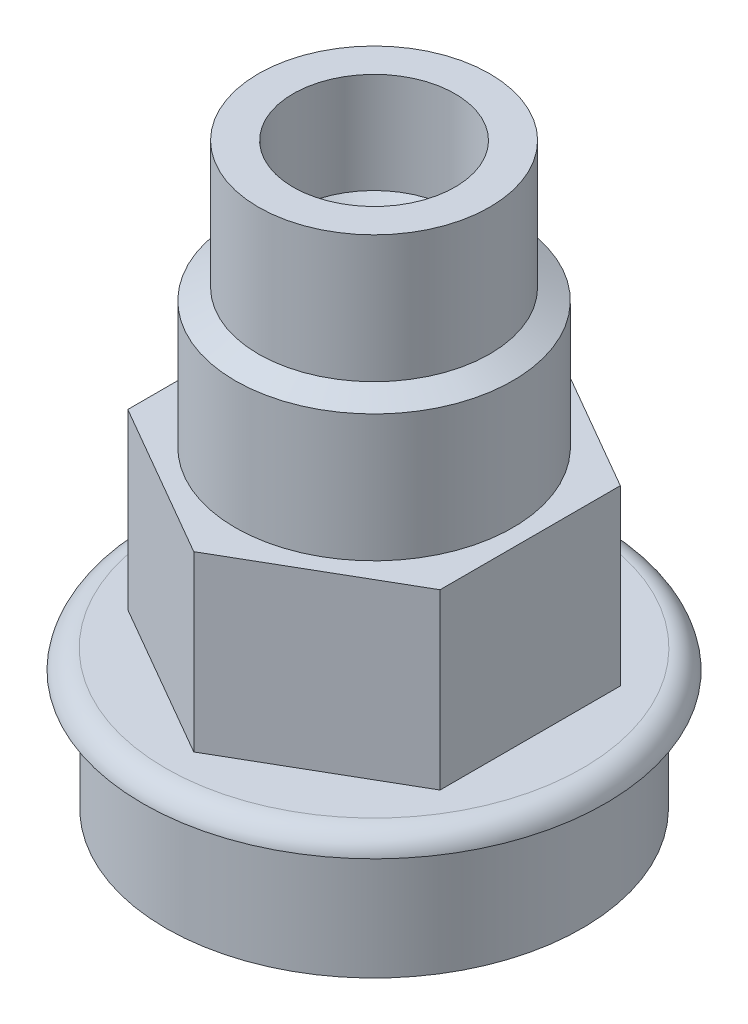
ISO-10303-21;
HEADER;
FILE_DESCRIPTION(('STEP AP214'),'2;1');
FILE_NAME('part.step','',(''),(''),'','','');
FILE_SCHEMA(('AUTOMOTIVE_DESIGN { 1 0 10303 214 1 1 1 1 }'));
ENDSEC;
DATA;
#1=APPLICATION_CONTEXT('core data for automotive mechanical design processes');
#2=APPLICATION_PROTOCOL_DEFINITION('international standard','automotive_design',2000,#1);
#3=PRODUCT_CONTEXT('',#1,'mechanical');
#4=PRODUCT('Part','Part','',(#3));
#5=PRODUCT_RELATED_PRODUCT_CATEGORY('part','',(#4));
#6=PRODUCT_DEFINITION_FORMATION('','',#4);
#7=PRODUCT_DEFINITION_CONTEXT('part definition',#1,'design');
#8=PRODUCT_DEFINITION('design','',#6,#7);
#9=PRODUCT_DEFINITION_SHAPE('','',#8);
#10=(LENGTH_UNIT() NAMED_UNIT(*) SI_UNIT(.MILLI.,.METRE.));
#11=(NAMED_UNIT(*) PLANE_ANGLE_UNIT() SI_UNIT($,.RADIAN.));
#12=(NAMED_UNIT(*) SI_UNIT($,.STERADIAN.) SOLID_ANGLE_UNIT());
#13=UNCERTAINTY_MEASURE_WITH_UNIT(LENGTH_MEASURE(1.E-05),#10,'distance_accuracy_value','');
#14=(GEOMETRIC_REPRESENTATION_CONTEXT(3) GLOBAL_UNCERTAINTY_ASSIGNED_CONTEXT((#13)) GLOBAL_UNIT_ASSIGNED_CONTEXT((#10,
#11,#12)) REPRESENTATION_CONTEXT('',''));
#15=CARTESIAN_POINT('',(0.,0.,0.));
#16=DIRECTION('',(0.,0.,1.));
#17=DIRECTION('',(1.,0.,0.));
#18=AXIS2_PLACEMENT_3D('',#15,#16,#17);
#19=CARTESIAN_POINT('',(0.,-13.,-13.));
#20=DIRECTION('',(0.,-1.,0.));
#21=DIRECTION('',(0.,0.,-1.));
#22=AXIS2_PLACEMENT_3D('',#19,#20,#21);
#23=PLANE('',#22);
#24=CARTESIAN_POINT('',(0.,-13.,0.));
#25=DIRECTION('',(0.,1.,0.));
#26=DIRECTION('',(0.,0.,1.));
#27=AXIS2_PLACEMENT_3D('',#24,#25,#26);
#28=CIRCLE('',#27,18.0292061100604);
#29=CARTESIAN_POINT('',(0.,-13.,18.0292061100604));
#30=VERTEX_POINT('',#29);
#31=EDGE_CURVE('E202',#30,#30,#28,.T.);
#32=ORIENTED_EDGE('',*,*,#31,.T.);
#33=EDGE_LOOP('',(#32));
#34=FACE_BOUND('',#33,.T.);
#35=DIRECTION('',(0.,0.,-1.));
#36=VECTOR('',#35,1.);
#37=CARTESIAN_POINT('',(13.5,-13.,7.79422863405995));
#38=LINE('',#37,#36);
#39=CARTESIAN_POINT('',(13.5,-13.,7.79422863405995));
#40=VERTEX_POINT('',#39);
#41=CARTESIAN_POINT('',(13.5,-13.,-7.79422863405996));
#42=VERTEX_POINT('',#41);
#43=EDGE_CURVE('E66',#40,#42,#38,.T.);
#44=ORIENTED_EDGE('',*,*,#43,.F.);
#45=DIRECTION('',(0.866025403784439,0.,-0.5));
#46=VECTOR('',#45,1.);
#47=CARTESIAN_POINT('',(0.,-13.,15.5884572681199));
#48=LINE('',#47,#46);
#49=CARTESIAN_POINT('',(0.,-13.,15.5884572681199));
#50=VERTEX_POINT('',#49);
#51=EDGE_CURVE('E71',#50,#40,#48,.T.);
#52=ORIENTED_EDGE('',*,*,#51,.F.);
#53=DIRECTION('',(0.866025403784439,0.,0.5));
#54=VECTOR('',#53,1.);
#55=CARTESIAN_POINT('',(-13.5,-13.,7.79422863405995));
#56=LINE('',#55,#54);
#57=CARTESIAN_POINT('',(-13.5,-13.,7.79422863405995));
#58=VERTEX_POINT('',#57);
#59=EDGE_CURVE('E163',#58,#50,#56,.T.);
#60=ORIENTED_EDGE('',*,*,#59,.F.);
#61=DIRECTION('',(0.,0.,1.));
#62=VECTOR('',#61,1.);
#63=CARTESIAN_POINT('',(-13.5,-13.,-7.79422863405996));
#64=LINE('',#63,#62);
#65=CARTESIAN_POINT('',(-13.5,-13.,-7.79422863405996));
#66=VERTEX_POINT('',#65);
#67=EDGE_CURVE('E159',#66,#58,#64,.T.);
#68=ORIENTED_EDGE('',*,*,#67,.F.);
#69=DIRECTION('',(-0.866025403784439,0.,0.5));
#70=VECTOR('',#69,1.);
#71=CARTESIAN_POINT('',(0.,-13.,-15.5884572681199));
#72=LINE('',#71,#70);
#73=CARTESIAN_POINT('',(0.,-13.,-15.5884572681199));
#74=VERTEX_POINT('',#73);
#75=EDGE_CURVE('E155',#74,#66,#72,.T.);
#76=ORIENTED_EDGE('',*,*,#75,.F.);
#77=DIRECTION('',(-0.866025403784439,0.,-0.5));
#78=VECTOR('',#77,1.);
#79=CARTESIAN_POINT('',(13.5,-13.,-7.79422863405996));
#80=LINE('',#79,#78);
#81=EDGE_CURVE('E152',#42,#74,#80,.T.);
#82=ORIENTED_EDGE('',*,*,#81,.F.);
#83=EDGE_LOOP('',(#44,#52,#60,#68,#76,#82));
#84=FACE_BOUND('',#83,.T.);
#85=ADVANCED_FACE('F49',(#34,#84),#23,.F.);
#86=CARTESIAN_POINT('',(0.,-25.,-18.));
#87=DIRECTION('',(0.,1.,0.));
#88=DIRECTION('',(0.,0.,1.));
#89=AXIS2_PLACEMENT_3D('',#86,#87,#88);
#90=PLANE('',#89);
#91=CARTESIAN_POINT('',(0.,-25.,0.));
#92=DIRECTION('',(0.,1.,0.));
#93=DIRECTION('',(0.,0.,1.));
#94=AXIS2_PLACEMENT_3D('',#91,#92,#93);
#95=CIRCLE('',#94,18.);
#96=CARTESIAN_POINT('',(0.,-25.,18.));
#97=VERTEX_POINT('',#96);
#98=EDGE_CURVE('E190',#97,#97,#95,.T.);
#99=ORIENTED_EDGE('',*,*,#98,.F.);
#100=EDGE_LOOP('',(#99));
#101=FACE_BOUND('',#100,.T.);
#102=CARTESIAN_POINT('',(0.,-25.,0.));
#103=DIRECTION('',(0.,1.,0.));
#104=DIRECTION('',(0.,0.,1.));
#105=AXIS2_PLACEMENT_3D('',#102,#103,#104);
#106=CIRCLE('',#105,14.1517153305609);
#107=CARTESIAN_POINT('',(0.,-25.,14.1517153305609));
#108=VERTEX_POINT('',#107);
#109=EDGE_CURVE('E53',#108,#108,#106,.T.);
#110=ORIENTED_EDGE('',*,*,#109,.T.);
#111=EDGE_LOOP('',(#110));
#112=FACE_BOUND('',#111,.T.);
#113=ADVANCED_FACE('F51',(#101,#112),#90,.F.);
#114=CARTESIAN_POINT('',(0.,-24.,0.));
#115=DIRECTION('',(0.,-1.,0.));
#116=DIRECTION('',(0.,0.,-1.));
#117=AXIS2_PLACEMENT_3D('',#114,#115,#116);
#118=CONICAL_SURFACE('',#117,13.,0.855790680962079);
#119=ORIENTED_EDGE('',*,*,#109,.F.);
#120=EDGE_LOOP('',(#119));
#121=FACE_BOUND('',#120,.T.);
#122=CARTESIAN_POINT('',(0.,-24.,0.));
#123=DIRECTION('',(0.,1.,0.));
#124=DIRECTION('',(0.,0.,1.));
#125=AXIS2_PLACEMENT_3D('',#122,#123,#124);
#126=CIRCLE('',#125,13.);
#127=CARTESIAN_POINT('',(0.,-24.,13.));
#128=VERTEX_POINT('',#127);
#129=EDGE_CURVE('E205',#128,#128,#126,.T.);
#130=ORIENTED_EDGE('',*,*,#129,.T.);
#131=EDGE_LOOP('',(#130));
#132=FACE_BOUND('',#131,.T.);
#133=ADVANCED_FACE('F215',(#121,#132),#118,.F.);
#134=CARTESIAN_POINT('',(0.,25.,0.));
#135=DIRECTION('',(0.,1.,0.));
#136=DIRECTION('',(0.,0.,1.));
#137=AXIS2_PLACEMENT_3D('',#134,#135,#136);
#138=CYLINDRICAL_SURFACE('',#137,13.);
#139=ORIENTED_EDGE('',*,*,#129,.F.);
#140=EDGE_LOOP('',(#139));
#141=FACE_BOUND('',#140,.T.);
#142=CARTESIAN_POINT('',(0.,-13.,0.));
#143=DIRECTION('',(0.,1.,0.));
#144=DIRECTION('',(0.,0.,1.));
#145=AXIS2_PLACEMENT_3D('',#142,#143,#144);
#146=CIRCLE('',#145,13.);
#147=CARTESIAN_POINT('',(0.,-13.,13.));
#148=VERTEX_POINT('',#147);
#149=EDGE_CURVE('E185',#148,#148,#146,.F.);
#150=ORIENTED_EDGE('',*,*,#149,.F.);
#151=EDGE_LOOP('',(#150));
#152=FACE_BOUND('',#151,.T.);
#153=ADVANCED_FACE('F217',(#141,#152),#138,.F.);
#154=CARTESIAN_POINT('',(0.,-15.,0.));
#155=DIRECTION('',(0.,1.,0.));
#156=DIRECTION('',(0.,0.,1.));
#157=AXIS2_PLACEMENT_3D('',#154,#155,#156);
#158=TOROIDAL_SURFACE('',#157,18.0292061100604,2.);
#159=ORIENTED_EDGE('',*,*,#31,.F.);
#160=EDGE_LOOP('',(#159));
#161=FACE_BOUND('',#160,.T.);
#162=CARTESIAN_POINT('',(0.,-14.6594541978282,0.));
#163=DIRECTION('',(0.,1.,0.));
#164=DIRECTION('',(0.,0.,1.));
#165=AXIS2_PLACEMENT_3D('',#162,#163,#164);
#166=CIRCLE('',#165,20.);
#167=CARTESIAN_POINT('',(0.,-14.6594541978282,20.));
#168=VERTEX_POINT('',#167);
#169=EDGE_CURVE('E198',#168,#168,#166,.T.);
#170=ORIENTED_EDGE('',*,*,#169,.T.);
#171=EDGE_LOOP('',(#170));
#172=FACE_BOUND('',#171,.T.);
#173=ADVANCED_FACE('F222',(#161,#172),#158,.T.);
#174=CARTESIAN_POINT('',(0.,-14.6594541978282,-20.));
#175=DIRECTION('',(0.,1.,0.));
#176=DIRECTION('',(0.,0.,1.));
#177=AXIS2_PLACEMENT_3D('',#174,#175,#176);
#178=PLANE('',#177);
#179=ORIENTED_EDGE('',*,*,#169,.F.);
#180=EDGE_LOOP('',(#179));
#181=FACE_BOUND('',#180,.T.);
#182=CARTESIAN_POINT('',(0.,-14.6594541978282,0.));
#183=DIRECTION('',(0.,1.,0.));
#184=DIRECTION('',(0.,0.,1.));
#185=AXIS2_PLACEMENT_3D('',#182,#183,#184);
#186=CIRCLE('',#185,18.);
#187=CARTESIAN_POINT('',(0.,-14.6594541978282,18.));
#188=VERTEX_POINT('',#187);
#189=EDGE_CURVE('E194',#188,#188,#186,.T.);
#190=ORIENTED_EDGE('',*,*,#189,.T.);
#191=EDGE_LOOP('',(#190));
#192=FACE_BOUND('',#191,.T.);
#193=ADVANCED_FACE('F234',(#181,#192),#178,.F.);
#194=CARTESIAN_POINT('',(0.,25.,0.));
#195=DIRECTION('',(0.,1.,0.));
#196=DIRECTION('',(0.,0.,1.));
#197=AXIS2_PLACEMENT_3D('',#194,#195,#196);
#198=CYLINDRICAL_SURFACE('',#197,18.);
#199=ORIENTED_EDGE('',*,*,#189,.F.);
#200=EDGE_LOOP('',(#199));
#201=FACE_BOUND('',#200,.T.);
#202=ORIENTED_EDGE('',*,*,#98,.T.);
#203=EDGE_LOOP('',(#202));
#204=FACE_BOUND('',#203,.T.);
#205=ADVANCED_FACE('F238',(#201,#204),#198,.T.);
#206=CARTESIAN_POINT('',(0.,-13.,0.));
#207=DIRECTION('',(0.,1.,0.));
#208=DIRECTION('',(0.,0.,1.));
#209=AXIS2_PLACEMENT_3D('',#206,#207,#208);
#210=PLANE('',#209);
#211=CARTESIAN_POINT('',(0.,-13.,0.));
#212=DIRECTION('',(0.,1.,0.));
#213=DIRECTION('',(0.,0.,1.));
#214=AXIS2_PLACEMENT_3D('',#211,#212,#213);
#215=CIRCLE('',#214,9.);
#216=CARTESIAN_POINT('',(0.,-13.,9.));
#217=VERTEX_POINT('',#216);
#218=EDGE_CURVE('E123',#217,#217,#215,.T.);
#219=ORIENTED_EDGE('',*,*,#218,.T.);
#220=EDGE_LOOP('',(#219));
#221=FACE_BOUND('',#220,.T.);
#222=ORIENTED_EDGE('',*,*,#149,.T.);
#223=EDGE_LOOP('',(#222));
#224=FACE_BOUND('',#223,.T.);
#225=ADVANCED_FACE('F242',(#221,#224),#210,.F.);
#226=CARTESIAN_POINT('',(13.5,43.2431812546026,7.79422863405996));
#227=DIRECTION('',(-1.,0.,0.));
#228=DIRECTION('',(0.,0.,1.));
#229=AXIS2_PLACEMENT_3D('',#226,#227,#228);
#230=PLANE('',#229);
#231=DIRECTION('',(0.,0.,-1.));
#232=VECTOR('',#231,1.);
#233=CARTESIAN_POINT('',(13.5,2.,7.79422863405995));
#234=LINE('',#233,#232);
#235=CARTESIAN_POINT('',(13.5,2.,7.79422863405995));
#236=VERTEX_POINT('',#235);
#237=CARTESIAN_POINT('',(13.5,2.,-7.79422863405996));
#238=VERTEX_POINT('',#237);
#239=EDGE_CURVE('E107',#236,#238,#234,.T.);
#240=ORIENTED_EDGE('',*,*,#239,.F.);
#241=DIRECTION('',(0.,-1.,0.));
#242=VECTOR('',#241,1.);
#243=CARTESIAN_POINT('',(13.5,43.2431812546026,7.79422863405996));
#244=LINE('',#243,#242);
#245=EDGE_CURVE('E112',#236,#40,#244,.T.);
#246=ORIENTED_EDGE('',*,*,#245,.T.);
#247=ORIENTED_EDGE('',*,*,#43,.T.);
#248=DIRECTION('',(0.,-1.,0.));
#249=VECTOR('',#248,1.);
#250=CARTESIAN_POINT('',(13.5,43.2431812546026,-7.79422863405995));
#251=LINE('',#250,#249);
#252=EDGE_CURVE('E103',#238,#42,#251,.T.);
#253=ORIENTED_EDGE('',*,*,#252,.F.);
#254=EDGE_LOOP('',(#240,#246,#247,#253));
#255=FACE_BOUND('',#254,.T.);
#256=ADVANCED_FACE('F105',(#255),#230,.F.);
#257=CARTESIAN_POINT('',(0.,43.2431812546026,15.5884572681199));
#258=DIRECTION('',(-0.5,0.,-0.866025403784439));
#259=DIRECTION('',(-0.866025403784439,0.,0.5));
#260=AXIS2_PLACEMENT_3D('',#257,#258,#259);
#261=PLANE('',#260);
#262=DIRECTION('',(0.866025403784439,0.,-0.5));
#263=VECTOR('',#262,1.);
#264=CARTESIAN_POINT('',(0.,1.99999999999999,15.5884572681199));
#265=LINE('',#264,#263);
#266=CARTESIAN_POINT('',(0.,1.99999999999999,15.5884572681199));
#267=VERTEX_POINT('',#266);
#268=EDGE_CURVE('E128',#267,#236,#265,.T.);
#269=ORIENTED_EDGE('',*,*,#268,.F.);
#270=DIRECTION('',(0.,-1.,0.));
#271=VECTOR('',#270,1.);
#272=CARTESIAN_POINT('',(0.,43.2431812546026,15.5884572681199));
#273=LINE('',#272,#271);
#274=EDGE_CURVE('E173',#267,#50,#273,.T.);
#275=ORIENTED_EDGE('',*,*,#274,.T.);
#276=ORIENTED_EDGE('',*,*,#51,.T.);
#277=ORIENTED_EDGE('',*,*,#245,.F.);
#278=EDGE_LOOP('',(#269,#275,#276,#277));
#279=FACE_BOUND('',#278,.T.);
#280=ADVANCED_FACE('F258',(#279),#261,.F.);
#281=CARTESIAN_POINT('',(-13.5,43.2431812546026,7.79422863405996));
#282=DIRECTION('',(0.5,0.,-0.866025403784439));
#283=DIRECTION('',(-0.866025403784439,0.,-0.5));
#284=AXIS2_PLACEMENT_3D('',#281,#282,#283);
#285=PLANE('',#284);
#286=DIRECTION('',(0.866025403784439,0.,0.5));
#287=VECTOR('',#286,1.);
#288=CARTESIAN_POINT('',(-13.5,2.,7.79422863405995));
#289=LINE('',#288,#287);
#290=CARTESIAN_POINT('',(-13.5,2.,7.79422863405995));
#291=VERTEX_POINT('',#290);
#292=EDGE_CURVE('E134',#291,#267,#289,.T.);
#293=ORIENTED_EDGE('',*,*,#292,.F.);
#294=DIRECTION('',(0.,-1.,0.));
#295=VECTOR('',#294,1.);
#296=CARTESIAN_POINT('',(-13.5,43.2431812546026,7.79422863405996));
#297=LINE('',#296,#295);
#298=EDGE_CURVE('E176',#291,#58,#297,.T.);
#299=ORIENTED_EDGE('',*,*,#298,.T.);
#300=ORIENTED_EDGE('',*,*,#59,.T.);
#301=ORIENTED_EDGE('',*,*,#274,.F.);
#302=EDGE_LOOP('',(#293,#299,#300,#301));
#303=FACE_BOUND('',#302,.T.);
#304=ADVANCED_FACE('F254',(#303),#285,.F.);
#305=CARTESIAN_POINT('',(-13.5,43.2431812546026,-7.79422863405995));
#306=DIRECTION('',(1.,0.,0.));
#307=DIRECTION('',(0.,0.,-1.));
#308=AXIS2_PLACEMENT_3D('',#305,#306,#307);
#309=PLANE('',#308);
#310=DIRECTION('',(0.,0.,1.));
#311=VECTOR('',#310,1.);
#312=CARTESIAN_POINT('',(-13.5,2.,-7.79422863405996));
#313=LINE('',#312,#311);
#314=CARTESIAN_POINT('',(-13.5,2.,-7.79422863405996));
#315=VERTEX_POINT('',#314);
#316=EDGE_CURVE('E143',#315,#291,#313,.T.);
#317=ORIENTED_EDGE('',*,*,#316,.F.);
#318=DIRECTION('',(0.,-1.,0.));
#319=VECTOR('',#318,1.);
#320=CARTESIAN_POINT('',(-13.5,43.2431812546026,-7.79422863405995));
#321=LINE('',#320,#319);
#322=EDGE_CURVE('E180',#315,#66,#321,.T.);
#323=ORIENTED_EDGE('',*,*,#322,.T.);
#324=ORIENTED_EDGE('',*,*,#67,.T.);
#325=ORIENTED_EDGE('',*,*,#298,.F.);
#326=EDGE_LOOP('',(#317,#323,#324,#325));
#327=FACE_BOUND('',#326,.T.);
#328=ADVANCED_FACE('F250',(#327),#309,.F.);
#329=CARTESIAN_POINT('',(0.,43.2431812546026,-15.5884572681199));
#330=DIRECTION('',(0.5,0.,0.866025403784439));
#331=DIRECTION('',(0.866025403784439,0.,-0.5));
#332=AXIS2_PLACEMENT_3D('',#329,#330,#331);
#333=PLANE('',#332);
#334=DIRECTION('',(-0.866025403784439,0.,0.5));
#335=VECTOR('',#334,1.);
#336=CARTESIAN_POINT('',(0.,2.,-15.5884572681199));
#337=LINE('',#336,#335);
#338=CARTESIAN_POINT('',(0.,2.,-15.5884572681199));
#339=VERTEX_POINT('',#338);
#340=EDGE_CURVE('E124',#339,#315,#337,.T.);
#341=ORIENTED_EDGE('',*,*,#340,.F.);
#342=DIRECTION('',(0.,-1.,0.));
#343=VECTOR('',#342,1.);
#344=CARTESIAN_POINT('',(0.,43.2431812546026,-15.5884572681199));
#345=LINE('',#344,#343);
#346=EDGE_CURVE('E119',#339,#74,#345,.T.);
#347=ORIENTED_EDGE('',*,*,#346,.T.);
#348=ORIENTED_EDGE('',*,*,#75,.T.);
#349=ORIENTED_EDGE('',*,*,#322,.F.);
#350=EDGE_LOOP('',(#341,#347,#348,#349));
#351=FACE_BOUND('',#350,.T.);
#352=ADVANCED_FACE('F247',(#351),#333,.F.);
#353=CARTESIAN_POINT('',(13.5,43.2431812546026,-7.79422863405995));
#354=DIRECTION('',(-0.5,0.,0.866025403784439));
#355=DIRECTION('',(0.866025403784439,0.,0.5));
#356=AXIS2_PLACEMENT_3D('',#353,#354,#355);
#357=PLANE('',#356);
#358=DIRECTION('',(-0.866025403784439,0.,-0.5));
#359=VECTOR('',#358,1.);
#360=CARTESIAN_POINT('',(13.5,2.,-7.79422863405995));
#361=LINE('',#360,#359);
#362=EDGE_CURVE('E116',#238,#339,#361,.T.);
#363=ORIENTED_EDGE('',*,*,#362,.F.);
#364=ORIENTED_EDGE('',*,*,#252,.T.);
#365=ORIENTED_EDGE('',*,*,#81,.T.);
#366=ORIENTED_EDGE('',*,*,#346,.F.);
#367=EDGE_LOOP('',(#363,#364,#365,#366));
#368=FACE_BOUND('',#367,.T.);
#369=ADVANCED_FACE('F117',(#368),#357,.F.);
#370=CARTESIAN_POINT('',(0.,43.2431812546026,0.));
#371=DIRECTION('',(0.,-1.,0.));
#372=DIRECTION('',(0.,0.,-1.));
#373=AXIS2_PLACEMENT_3D('',#370,#371,#372);
#374=CYLINDRICAL_SURFACE('',#373,9.);
#375=ORIENTED_EDGE('',*,*,#218,.F.);
#376=EDGE_LOOP('',(#375));
#377=FACE_BOUND('',#376,.T.);
#378=CARTESIAN_POINT('',(0.,2.,0.));
#379=DIRECTION('',(0.,1.,0.));
#380=DIRECTION('',(0.,0.,1.));
#381=AXIS2_PLACEMENT_3D('',#378,#379,#380);
#382=CIRCLE('',#381,9.);
#383=CARTESIAN_POINT('',(0.,2.,9.));
#384=VERTEX_POINT('',#383);
#385=EDGE_CURVE('E130',#384,#384,#382,.T.);
#386=ORIENTED_EDGE('',*,*,#385,.T.);
#387=EDGE_LOOP('',(#386));
#388=FACE_BOUND('',#387,.T.);
#389=ADVANCED_FACE('F246',(#377,#388),#374,.F.);
#390=CARTESIAN_POINT('',(0.,2.,-7.));
#391=DIRECTION('',(0.,1.,0.));
#392=DIRECTION('',(0.,0.,1.));
#393=AXIS2_PLACEMENT_3D('',#390,#391,#392);
#394=PLANE('',#393);
#395=CARTESIAN_POINT('',(0.,2.,0.));
#396=DIRECTION('',(0.,1.,0.));
#397=DIRECTION('',(0.,0.,1.));
#398=AXIS2_PLACEMENT_3D('',#395,#396,#397);
#399=CIRCLE('',#398,12.);
#400=CARTESIAN_POINT('',(0.,2.,12.));
#401=VERTEX_POINT('',#400);
#402=EDGE_CURVE('E11',#401,#401,#399,.T.);
#403=ORIENTED_EDGE('',*,*,#402,.F.);
#404=EDGE_LOOP('',(#403));
#405=FACE_BOUND('',#404,.T.);
#406=ORIENTED_EDGE('',*,*,#239,.T.);
#407=ORIENTED_EDGE('',*,*,#362,.T.);
#408=ORIENTED_EDGE('',*,*,#340,.T.);
#409=ORIENTED_EDGE('',*,*,#316,.T.);
#410=ORIENTED_EDGE('',*,*,#292,.T.);
#411=ORIENTED_EDGE('',*,*,#268,.T.);
#412=EDGE_LOOP('',(#406,#407,#408,#409,#410,#411));
#413=FACE_BOUND('',#412,.T.);
#414=ADVANCED_FACE('F126',(#405,#413),#394,.T.);
#415=CARTESIAN_POINT('',(0.,2.,-7.));
#416=DIRECTION('',(0.,1.,0.));
#417=DIRECTION('',(0.,0.,1.));
#418=AXIS2_PLACEMENT_3D('',#415,#416,#417);
#419=PLANE('',#418);
#420=ORIENTED_EDGE('',*,*,#385,.F.);
#421=EDGE_LOOP('',(#420));
#422=FACE_BOUND('',#421,.T.);
#423=CARTESIAN_POINT('',(0.,2.,0.));
#424=DIRECTION('',(0.,1.,0.));
#425=DIRECTION('',(0.,0.,1.));
#426=AXIS2_PLACEMENT_3D('',#423,#424,#425);
#427=CIRCLE('',#426,7.00000000000001);
#428=CARTESIAN_POINT('',(0.,2.,7.00000000000001));
#429=VERTEX_POINT('',#428);
#430=EDGE_CURVE('E318',#429,#429,#427,.T.);
#431=ORIENTED_EDGE('',*,*,#430,.T.);
#432=EDGE_LOOP('',(#431));
#433=FACE_BOUND('',#432,.T.);
#434=ADVANCED_FACE('F273',(#422,#433),#419,.F.);
#435=CARTESIAN_POINT('',(0.,25.,0.));
#436=DIRECTION('',(0.,1.,0.));
#437=DIRECTION('',(0.,0.,1.));
#438=AXIS2_PLACEMENT_3D('',#435,#436,#437);
#439=CYLINDRICAL_SURFACE('',#438,12.);
#440=CARTESIAN_POINT('',(0.,13.,0.));
#441=DIRECTION('',(0.,1.,0.));
#442=DIRECTION('',(0.,0.,1.));
#443=AXIS2_PLACEMENT_3D('',#440,#441,#442);
#444=CIRCLE('',#443,12.);
#445=CARTESIAN_POINT('',(0.,13.,12.));
#446=VERTEX_POINT('',#445);
#447=EDGE_CURVE('E137',#446,#446,#444,.T.);
#448=ORIENTED_EDGE('',*,*,#447,.F.);
#449=EDGE_LOOP('',(#448));
#450=FACE_BOUND('',#449,.T.);
#451=ORIENTED_EDGE('',*,*,#402,.T.);
#452=EDGE_LOOP('',(#451));
#453=FACE_BOUND('',#452,.T.);
#454=ADVANCED_FACE('F277',(#450,#453),#439,.T.);
#455=CARTESIAN_POINT('',(0.,13.,0.));
#456=DIRECTION('',(0.,-1.,0.));
#457=DIRECTION('',(0.,0.,-1.));
#458=AXIS2_PLACEMENT_3D('',#455,#456,#457);
#459=CONICAL_SURFACE('',#458,12.,1.10714871779409);
#460=CARTESIAN_POINT('',(0.,14.,0.));
#461=DIRECTION('',(0.,1.,0.));
#462=DIRECTION('',(0.,0.,1.));
#463=AXIS2_PLACEMENT_3D('',#460,#461,#462);
#464=CIRCLE('',#463,10.);
#465=CARTESIAN_POINT('',(0.,14.,10.));
#466=VERTEX_POINT('',#465);
#467=EDGE_CURVE('E347',#466,#466,#464,.T.);
#468=ORIENTED_EDGE('',*,*,#467,.F.);
#469=EDGE_LOOP('',(#468));
#470=FACE_BOUND('',#469,.T.);
#471=ORIENTED_EDGE('',*,*,#447,.T.);
#472=EDGE_LOOP('',(#471));
#473=FACE_BOUND('',#472,.T.);
#474=ADVANCED_FACE('F281',(#470,#473),#459,.T.);
#475=CARTESIAN_POINT('',(0.,25.,0.));
#476=DIRECTION('',(0.,1.,0.));
#477=DIRECTION('',(0.,0.,1.));
#478=AXIS2_PLACEMENT_3D('',#475,#476,#477);
#479=CYLINDRICAL_SURFACE('',#478,10.);
#480=CARTESIAN_POINT('',(0.,25.,0.));
#481=DIRECTION('',(0.,1.,0.));
#482=DIRECTION('',(0.,0.,1.));
#483=AXIS2_PLACEMENT_3D('',#480,#481,#482);
#484=CIRCLE('',#483,10.);
#485=CARTESIAN_POINT('',(0.,25.,10.));
#486=VERTEX_POINT('',#485);
#487=EDGE_CURVE('E343',#486,#486,#484,.T.);
#488=ORIENTED_EDGE('',*,*,#487,.F.);
#489=EDGE_LOOP('',(#488));
#490=FACE_BOUND('',#489,.T.);
#491=ORIENTED_EDGE('',*,*,#467,.T.);
#492=EDGE_LOOP('',(#491));
#493=FACE_BOUND('',#492,.T.);
#494=ADVANCED_FACE('F285',(#490,#493),#479,.T.);
#495=CARTESIAN_POINT('',(0.,25.,-10.));
#496=DIRECTION('',(0.,-1.,0.));
#497=DIRECTION('',(0.,0.,-1.));
#498=AXIS2_PLACEMENT_3D('',#495,#496,#497);
#499=PLANE('',#498);
#500=CARTESIAN_POINT('',(0.,25.,0.));
#501=DIRECTION('',(0.,1.,0.));
#502=DIRECTION('',(0.,0.,1.));
#503=AXIS2_PLACEMENT_3D('',#500,#501,#502);
#504=CIRCLE('',#503,7.00000000000001);
#505=CARTESIAN_POINT('',(0.,25.,7.00000000000002));
#506=VERTEX_POINT('',#505);
#507=EDGE_CURVE('E339',#506,#506,#504,.T.);
#508=ORIENTED_EDGE('',*,*,#507,.F.);
#509=EDGE_LOOP('',(#508));
#510=FACE_BOUND('',#509,.T.);
#511=ORIENTED_EDGE('',*,*,#487,.T.);
#512=EDGE_LOOP('',(#511));
#513=FACE_BOUND('',#512,.T.);
#514=ADVANCED_FACE('F289',(#510,#513),#499,.F.);
#515=CARTESIAN_POINT('',(0.,25.,0.));
#516=DIRECTION('',(0.,1.,0.));
#517=DIRECTION('',(0.,0.,1.));
#518=AXIS2_PLACEMENT_3D('',#515,#516,#517);
#519=CYLINDRICAL_SURFACE('',#518,7.00000000000001);
#520=CARTESIAN_POINT('',(0.,16.3,0.));
#521=DIRECTION('',(0.,1.,0.));
#522=DIRECTION('',(0.,0.,1.));
#523=AXIS2_PLACEMENT_3D('',#520,#521,#522);
#524=CIRCLE('',#523,7.00000000000001);
#525=CARTESIAN_POINT('',(0.,16.3,7.00000000000002));
#526=VERTEX_POINT('',#525);
#527=EDGE_CURVE('E335',#526,#526,#524,.T.);
#528=ORIENTED_EDGE('',*,*,#527,.F.);
#529=EDGE_LOOP('',(#528));
#530=FACE_BOUND('',#529,.T.);
#531=ORIENTED_EDGE('',*,*,#507,.T.);
#532=EDGE_LOOP('',(#531));
#533=FACE_BOUND('',#532,.T.);
#534=ADVANCED_FACE('F293',(#530,#533),#519,.F.);
#535=CARTESIAN_POINT('',(0.,16.3,0.));
#536=DIRECTION('',(0.,1.,0.));
#537=DIRECTION('',(0.,0.,1.));
#538=AXIS2_PLACEMENT_3D('',#535,#536,#537);
#539=CONICAL_SURFACE('',#538,7.00000000000001,0.785398163397447);
#540=CARTESIAN_POINT('',(0.,15.3,0.));
#541=DIRECTION('',(0.,1.,0.));
#542=DIRECTION('',(0.,0.,1.));
#543=AXIS2_PLACEMENT_3D('',#540,#541,#542);
#544=CIRCLE('',#543,6.00000000000001);
#545=CARTESIAN_POINT('',(0.,15.3,6.00000000000002));
#546=VERTEX_POINT('',#545);
#547=EDGE_CURVE('E328',#546,#546,#544,.T.);
#548=ORIENTED_EDGE('',*,*,#547,.F.);
#549=EDGE_LOOP('',(#548));
#550=FACE_BOUND('',#549,.T.);
#551=ORIENTED_EDGE('',*,*,#527,.T.);
#552=EDGE_LOOP('',(#551));
#553=FACE_BOUND('',#552,.T.);
#554=ADVANCED_FACE('F297',(#550,#553),#539,.F.);
#555=CARTESIAN_POINT('',(0.,25.,0.));
#556=DIRECTION('',(0.,1.,0.));
#557=DIRECTION('',(0.,0.,1.));
#558=AXIS2_PLACEMENT_3D('',#555,#556,#557);
#559=CYLINDRICAL_SURFACE('',#558,6.00000000000001);
#560=CARTESIAN_POINT('',(0.,10.,0.));
#561=DIRECTION('',(0.,1.,0.));
#562=DIRECTION('',(0.,0.,1.));
#563=AXIS2_PLACEMENT_3D('',#560,#561,#562);
#564=CIRCLE('',#563,6.00000000000001);
#565=CARTESIAN_POINT('',(0.,10.,6.00000000000001));
#566=VERTEX_POINT('',#565);
#567=EDGE_CURVE('E323',#566,#566,#564,.T.);
#568=ORIENTED_EDGE('',*,*,#567,.F.);
#569=EDGE_LOOP('',(#568));
#570=FACE_BOUND('',#569,.T.);
#571=ORIENTED_EDGE('',*,*,#547,.T.);
#572=EDGE_LOOP('',(#571));
#573=FACE_BOUND('',#572,.T.);
#574=ADVANCED_FACE('F301',(#570,#573),#559,.F.);
#575=CARTESIAN_POINT('',(0.,10.,-6.));
#576=DIRECTION('',(0.,1.,0.));
#577=DIRECTION('',(0.,0.,1.));
#578=AXIS2_PLACEMENT_3D('',#575,#576,#577);
#579=PLANE('',#578);
#580=CARTESIAN_POINT('',(0.,10.,0.));
#581=DIRECTION('',(0.,1.,0.));
#582=DIRECTION('',(0.,0.,1.));
#583=AXIS2_PLACEMENT_3D('',#580,#581,#582);
#584=CIRCLE('',#583,7.00000000000001);
#585=CARTESIAN_POINT('',(0.,10.,7.00000000000002));
#586=VERTEX_POINT('',#585);
#587=EDGE_CURVE('E321',#586,#586,#584,.T.);
#588=ORIENTED_EDGE('',*,*,#587,.F.);
#589=EDGE_LOOP('',(#588));
#590=FACE_BOUND('',#589,.T.);
#591=ORIENTED_EDGE('',*,*,#567,.T.);
#592=EDGE_LOOP('',(#591));
#593=FACE_BOUND('',#592,.T.);
#594=ADVANCED_FACE('F305',(#590,#593),#579,.F.);
#595=CARTESIAN_POINT('',(0.,25.,0.));
#596=DIRECTION('',(0.,1.,0.));
#597=DIRECTION('',(0.,0.,1.));
#598=AXIS2_PLACEMENT_3D('',#595,#596,#597);
#599=CYLINDRICAL_SURFACE('',#598,7.00000000000001);
#600=ORIENTED_EDGE('',*,*,#430,.F.);
#601=EDGE_LOOP('',(#600));
#602=FACE_BOUND('',#601,.T.);
#603=ORIENTED_EDGE('',*,*,#587,.T.);
#604=EDGE_LOOP('',(#603));
#605=FACE_BOUND('',#604,.T.);
#606=ADVANCED_FACE('F309',(#602,#605),#599,.F.);
#607=CLOSED_SHELL('',(#85,#113,#133,#153,#173,#193,#205,#225,#256,#280,#304,#328,#352,#369,#389,
#414,#434,#454,#474,#494,#514,#534,#554,#574,#594,#606));
#608=MANIFOLD_SOLID_BREP('B2',#607);
#609=ADVANCED_BREP_SHAPE_REPRESENTATION('',(#18,#608),#14);
#610=SHAPE_DEFINITION_REPRESENTATION(#9,#609);
ENDSEC;
END-ISO-10303-21;
